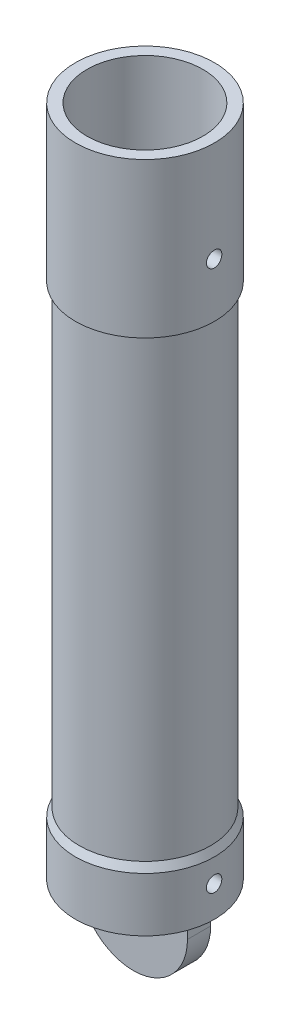
ISO-10303-21;
HEADER;
FILE_DESCRIPTION(('STEP AP214'),'2;1');
FILE_NAME('part.step','',(''),(''),'','','');
FILE_SCHEMA(('AUTOMOTIVE_DESIGN { 1 0 10303 214 1 1 1 1 }'));
ENDSEC;
DATA;
#1=APPLICATION_CONTEXT('core data for automotive mechanical design processes');
#2=APPLICATION_PROTOCOL_DEFINITION('international standard','automotive_design',2000,#1);
#3=PRODUCT_CONTEXT('',#1,'mechanical');
#4=PRODUCT('Part','Part','',(#3));
#5=PRODUCT_RELATED_PRODUCT_CATEGORY('part','',(#4));
#6=PRODUCT_DEFINITION_FORMATION('','',#4);
#7=PRODUCT_DEFINITION_CONTEXT('part definition',#1,'design');
#8=PRODUCT_DEFINITION('design','',#6,#7);
#9=PRODUCT_DEFINITION_SHAPE('','',#8);
#10=(LENGTH_UNIT() NAMED_UNIT(*) SI_UNIT(.MILLI.,.METRE.));
#11=(NAMED_UNIT(*) PLANE_ANGLE_UNIT() SI_UNIT($,.RADIAN.));
#12=(NAMED_UNIT(*) SI_UNIT($,.STERADIAN.) SOLID_ANGLE_UNIT());
#13=UNCERTAINTY_MEASURE_WITH_UNIT(LENGTH_MEASURE(1.E-05),#10,'distance_accuracy_value','');
#14=(GEOMETRIC_REPRESENTATION_CONTEXT(3) GLOBAL_UNCERTAINTY_ASSIGNED_CONTEXT((#13)) GLOBAL_UNIT_ASSIGNED_CONTEXT((#10,
#11,#12)) REPRESENTATION_CONTEXT('',''));
#15=CARTESIAN_POINT('',(0.,0.,0.));
#16=DIRECTION('',(0.,0.,1.));
#17=DIRECTION('',(1.,0.,0.));
#18=AXIS2_PLACEMENT_3D('',#15,#16,#17);
#19=CARTESIAN_POINT('',(0.,87.,0.));
#20=DIRECTION('',(0.,1.,0.));
#21=DIRECTION('',(0.,0.,1.));
#22=AXIS2_PLACEMENT_3D('',#19,#20,#21);
#23=CYLINDRICAL_SURFACE('',#22,8.99999999999999);
#24=CARTESIAN_POINT('',(0.,6.99999999999999,0.));
#25=DIRECTION('',(0.,1.,0.));
#26=DIRECTION('',(0.,0.,1.));
#27=AXIS2_PLACEMENT_3D('',#24,#25,#26);
#28=CIRCLE('',#27,8.99999999999999);
#29=CARTESIAN_POINT('',(0.,6.99999999999999,8.99999999999999));
#30=VERTEX_POINT('',#29);
#31=EDGE_CURVE('E54',#30,#30,#28,.T.);
#32=ORIENTED_EDGE('',*,*,#31,.F.);
#33=EDGE_LOOP('',(#32));
#34=FACE_BOUND('',#33,.T.);
#35=CARTESIAN_POINT('',(0.,0.,0.));
#36=DIRECTION('',(0.,1.,0.));
#37=DIRECTION('',(0.,0.,1.));
#38=AXIS2_PLACEMENT_3D('',#35,#36,#37);
#39=CIRCLE('',#38,8.99999999999998);
#40=CARTESIAN_POINT('',(0.,0.,8.99999999999998));
#41=VERTEX_POINT('',#40);
#42=EDGE_CURVE('E11',#41,#41,#39,.T.);
#43=ORIENTED_EDGE('',*,*,#42,.T.);
#44=EDGE_LOOP('',(#43));
#45=FACE_BOUND('',#44,.T.);
#46=CARTESIAN_POINT('',(8.94427190999915,4.,0.999999999999991));
#47=CARTESIAN_POINT('',(8.94427263367564,4.0559841134771,0.999997592517866));
#48=CARTESIAN_POINT('',(8.94480320415308,4.1120043997645,0.995282822112467));
#49=CARTESIAN_POINT('',(8.94686765346893,4.22248934405692,0.976547278566342));
#50=CARTESIAN_POINT('',(8.94840261407587,4.27695225862483,0.962516471439655));
#51=CARTESIAN_POINT('',(8.95229988148852,4.38270661902511,0.925564609414928));
#52=CARTESIAN_POINT('',(8.95466166163705,4.43400005929836,0.90264921271523));
#53=CARTESIAN_POINT('',(8.95994581317674,4.53200251564655,0.84859006992609));
#54=CARTESIAN_POINT('',(8.96286807969104,4.57871238692008,0.817447862806936));
#55=CARTESIAN_POINT('',(8.9689585152234,4.66644024909067,0.747670331059766));
#56=CARTESIAN_POINT('',(8.97212761419109,4.70743491317915,0.709005756930013));
#57=CARTESIAN_POINT('',(8.97834623227898,4.7823675269533,0.625343781006231));
#58=CARTESIAN_POINT('',(8.98139574572674,4.8163051422211,0.580346079268701));
#59=CARTESIAN_POINT('',(8.98704094371251,4.87624237130181,0.485150487955424));
#60=CARTESIAN_POINT('',(8.98963542778045,4.9022211186168,0.434939383130966));
#61=CARTESIAN_POINT('',(8.99406807097665,4.94536961809943,0.33083373575899));
#62=CARTESIAN_POINT('',(8.99590625254781,4.96253963166566,0.276939302567778));
#63=CARTESIAN_POINT('',(8.99861263899253,4.98751424661088,0.16723400431094));
#64=CARTESIAN_POINT('',(8.99948483524638,4.99535739589416,0.111432014779645));
#65=CARTESIAN_POINT('',(9.00017457787682,5.00157499865148,-0.000702562392763186));
#66=CARTESIAN_POINT('',(8.9999921575105,4.99994975070937,-0.0570351332461794));
#67=CARTESIAN_POINT('',(8.99859647140739,4.98730781760897,-0.168369872939793));
#68=CARTESIAN_POINT('',(8.99738775579825,4.97633258532411,-0.223376813736908));
#69=CARTESIAN_POINT('',(8.99408046986786,4.94536690073653,-0.33076313724934));
#70=CARTESIAN_POINT('',(8.99198188570147,4.92537630816683,-0.38314247906863));
#71=CARTESIAN_POINT('',(8.98712289889433,4.87690248439166,-0.483916439759069));
#72=CARTESIAN_POINT('',(8.98436108245631,4.84840107884412,-0.532302245558599));
#73=CARTESIAN_POINT('',(8.9784851551257,4.78372788465659,-0.623619484715406));
#74=CARTESIAN_POINT('',(8.97537103146679,4.74755581801872,-0.666550720299529));
#75=CARTESIAN_POINT('',(8.96911970576882,4.66833535845642,-0.745983267326595));
#76=CARTESIAN_POINT('',(8.96598246993294,4.625250876728,-0.782448593166379));
#77=CARTESIAN_POINT('',(8.96005521211825,4.53355323765733,-0.847635154523864));
#78=CARTESIAN_POINT('',(8.95726519085753,4.48494006888121,-0.876356374025599));
#79=CARTESIAN_POINT('',(8.95234814495896,4.38353551326513,-0.925240185526878));
#80=CARTESIAN_POINT('',(8.95022131384814,4.33074291244021,-0.945400279904722));
#81=CARTESIAN_POINT('',(8.94687537727144,4.22249299212105,-0.976559666068446));
#82=CARTESIAN_POINT('',(8.94565623749051,4.16703577344642,-0.98755930416501));
#83=CARTESIAN_POINT('',(8.9442698173594,4.05534755348248,-1.00003867967785));
#84=CARTESIAN_POINT('',(8.9440969608419,3.99912225770337,-1.00156888541939));
#85=CARTESIAN_POINT('',(8.9448079519288,3.88721608648433,-0.995198759551084));
#86=CARTESIAN_POINT('',(8.94569178183337,3.83153520194108,-0.987298585903113));
#87=CARTESIAN_POINT('',(8.94841148256714,3.72244725733017,-0.962334295937802));
#88=CARTESIAN_POINT('',(8.95024484892915,3.66903461366211,-0.945294282379431));
#89=CARTESIAN_POINT('',(8.95465502047817,3.56582531440804,-0.902558706994963));
#90=CARTESIAN_POINT('',(8.95723184653214,3.51602876036521,-0.876862902220315));
#91=CARTESIAN_POINT('',(8.96285203814232,3.42123585340321,-0.817419705165285));
#92=CARTESIAN_POINT('',(8.96589731402505,3.37626049653097,-0.783639014378045));
#93=CARTESIAN_POINT('',(8.97210513969874,3.29260013138305,-0.709032406964774));
#94=CARTESIAN_POINT('',(8.97526769307831,3.25391531578897,-0.668206274613186));
#95=CARTESIAN_POINT('',(8.98137069627023,3.18375875733989,-0.580448104861658));
#96=CARTESIAN_POINT('',(8.98431008980797,3.15232003836093,-0.533489583366008));
#97=CARTESIAN_POINT('',(8.98962004039812,3.0977758715866,-0.4349295798185));
#98=CARTESIAN_POINT('',(8.99199060680961,3.07467028668082,-0.383328174176462));
#99=CARTESIAN_POINT('',(8.99589107248184,3.03750363555143,-0.277060132472978));
#100=CARTESIAN_POINT('',(8.9974227910967,3.02342298399711,-0.222400415783423));
#101=CARTESIAN_POINT('',(8.99948048346295,3.00464205926624,-0.111474600378969));
#102=CARTESIAN_POINT('',(9.00000649258982,2.99994145614946,-0.0552085582366774));
#103=CARTESIAN_POINT('',(8.99999341978675,3.0000593318663,0.0570091672484356));
#104=CARTESIAN_POINT('',(8.99946005766743,3.00482669078709,0.112960911922288));
#105=CARTESIAN_POINT('',(8.99739948433674,3.02363751839051,0.223263158463222));
#106=CARTESIAN_POINT('',(8.99587227289396,3.03768098923301,0.277613659957462));
#107=CARTESIAN_POINT('',(8.99199497720235,3.07463042201869,0.383167538307865));
#108=CARTESIAN_POINT('',(8.98964506961353,3.09753448141185,0.434371588038429));
#109=CARTESIAN_POINT('',(8.98438359909208,3.15154959198276,0.532216958324803));
#110=CARTESIAN_POINT('',(8.98147203523691,3.18266065664069,0.578858271386052));
#111=CARTESIAN_POINT('',(8.97539414841482,3.25239744820852,0.666515949250362));
#112=CARTESIAN_POINT('',(8.97222658393825,3.29106126569852,0.707501925820602));
#113=CARTESIAN_POINT('',(8.96600400083303,3.3747286645393,0.782425417953726));
#114=CARTESIAN_POINT('',(8.96294900923111,3.41973375596681,0.816361249856326));
#115=CARTESIAN_POINT('',(8.95728742883614,3.51496158983686,0.876307066925751));
#116=CARTESIAN_POINT('',(8.95468224997416,3.56519997432892,0.902292320826923));
#117=CARTESIAN_POINT('',(8.95023190563829,3.66932571842171,0.945422239485245));
#118=CARTESIAN_POINT('',(8.94838589612408,3.72320894763475,0.962576727612482));
#119=CARTESIAN_POINT('',(8.9461212655064,3.81448893747225,0.9833512157742));
#120=CARTESIAN_POINT('',(8.9454311087166,3.85130518115984,0.989585793834217));
#121=CARTESIAN_POINT('',(8.94450619111617,3.92540893153466,0.997910976611049));
#122=CARTESIAN_POINT('',(8.94427142779606,3.96269643562383,1.00000160416337));
#123=CARTESIAN_POINT('',(8.94427190999915,4.,0.999999999999991));
#124=B_SPLINE_CURVE_WITH_KNOTS('',3,(#46,#47,#48,#49,#50,#51,#52,#53,#54,#55,#56,#57,#58,#59,
#60,#61,#62,#63,#64,#65,#66,#67,#68,#69,#70,#71,#72,#73,#74,#75,#76,#77,#78,#79,#80,#81,#82,#83,
#84,#85,#86,#87,#88,#89,#90,#91,#92,#93,#94,#95,#96,#97,#98,#99,#100,#101,#102,#103,#104,#105,
#106,#107,#108,#109,#110,#111,#112,#113,#114,#115,#116,#117,#118,#119,#120,#121,#122,#123),
.UNSPECIFIED.,.T.,.F.,(4,2,2,2,2,2,2,2,2,2,2,2,2,2,2,2,2,2,2,2,2,2,2,2,2,2,2,2,2,2,2,2,2,2,2,2,
2,2,4),(0.,0.167816094312486,0.335813231467328,0.503703554025014,0.671562491943662,
0.840087659677712,1.00862081162626,1.17759211396053,1.34655840179297,1.51482389806978,
1.68308408815944,1.85060216087683,2.01812284004196,2.18600383962577,2.35389092454426,
2.52268489532751,2.69147921519915,2.8603227453326,3.02915989205335,3.19709642315278,
3.36503014130095,3.53252316164429,3.70002088353095,3.86822070886243,4.03642568524668,
4.20538272665268,4.37433698797281,4.54292334295312,4.71150376785724,4.8791764590021,
5.0468491891884,5.21448593656706,5.38212295929421,5.55062832814459,5.71917389198524,
5.88823852910646,6.05711468959689,6.16893521484786,6.28075512390304),.UNSPECIFIED.);
#125=CARTESIAN_POINT('',(8.94427190999915,4.,0.999999999999991));
#126=VERTEX_POINT('',#125);
#127=EDGE_CURVE('E181',#126,#126,#124,.T.);
#128=ORIENTED_EDGE('',*,*,#127,.T.);
#129=EDGE_LOOP('',(#128));
#130=FACE_BOUND('',#129,.T.);
#131=ADVANCED_FACE('F39',(#34,#45,#130),#23,.T.);
#132=CARTESIAN_POINT('',(0.,87.,0.));
#133=DIRECTION('',(0.,1.,0.));
#134=DIRECTION('',(0.,0.,1.));
#135=AXIS2_PLACEMENT_3D('',#132,#133,#134);
#136=CYLINDRICAL_SURFACE('',#135,9.);
#137=CARTESIAN_POINT('',(0.,87.,0.));
#138=DIRECTION('',(0.,1.,0.));
#139=DIRECTION('',(0.,0.,1.));
#140=AXIS2_PLACEMENT_3D('',#137,#138,#139);
#141=CIRCLE('',#140,9.);
#142=CARTESIAN_POINT('',(0.,87.,9.));
#143=VERTEX_POINT('',#142);
#144=EDGE_CURVE('E156',#143,#143,#141,.T.);
#145=ORIENTED_EDGE('',*,*,#144,.F.);
#146=EDGE_LOOP('',(#145));
#147=FACE_BOUND('',#146,.T.);
#148=CARTESIAN_POINT('',(0.,67.,0.));
#149=DIRECTION('',(0.,1.,0.));
#150=DIRECTION('',(0.,0.,1.));
#151=AXIS2_PLACEMENT_3D('',#148,#149,#150);
#152=CIRCLE('',#151,9.);
#153=CARTESIAN_POINT('',(0.,67.,9.));
#154=VERTEX_POINT('',#153);
#155=EDGE_CURVE('E160',#154,#154,#152,.T.);
#156=ORIENTED_EDGE('',*,*,#155,.T.);
#157=EDGE_LOOP('',(#156));
#158=FACE_BOUND('',#157,.T.);
#159=CARTESIAN_POINT('',(8.94427190999916,74.,1.));
#160=CARTESIAN_POINT('',(8.94427263367565,74.0559841134771,0.999997592517876));
#161=CARTESIAN_POINT('',(8.94480320415309,74.1120043997645,0.995282822112477));
#162=CARTESIAN_POINT('',(8.94686765346894,74.2224893440569,0.976547278566351));
#163=CARTESIAN_POINT('',(8.94840261407588,74.2769522586248,0.962516471439663));
#164=CARTESIAN_POINT('',(8.95229988148853,74.3827066190251,0.925564609414937));
#165=CARTESIAN_POINT('',(8.95466166163706,74.4340000592984,0.902649212715241));
#166=CARTESIAN_POINT('',(8.95994581317675,74.5320025156466,0.8485900699261));
#167=CARTESIAN_POINT('',(8.96286807969105,74.5787123869201,0.81744786280694));
#168=CARTESIAN_POINT('',(8.96895851522341,74.6664402490907,0.747670331059766));
#169=CARTESIAN_POINT('',(8.9721276141911,74.7074349131792,0.709005756930015));
#170=CARTESIAN_POINT('',(8.97834623227899,74.7823675269533,0.625343781006238));
#171=CARTESIAN_POINT('',(8.98139574572675,74.8163051422211,0.58034607926871));
#172=CARTESIAN_POINT('',(8.98704094371252,74.8762423713018,0.485150487955433));
#173=CARTESIAN_POINT('',(8.98963542778046,74.9022211186168,0.434939383130973));
#174=CARTESIAN_POINT('',(8.99406807097666,74.9453696180994,0.330833735758996));
#175=CARTESIAN_POINT('',(8.99590625254782,74.9625396316657,0.276939302567785));
#176=CARTESIAN_POINT('',(8.99861263899254,74.9875142466109,0.167234004310947));
#177=CARTESIAN_POINT('',(8.99948483524639,74.9953573958942,0.111432014779651));
#178=CARTESIAN_POINT('',(9.00017457787683,75.0015749986515,-0.0007025623927587));
#179=CARTESIAN_POINT('',(8.99999215751051,74.9999497507094,-0.0570351332461753));
#180=CARTESIAN_POINT('',(8.9985964714074,74.987307817609,-0.16836987293979));
#181=CARTESIAN_POINT('',(8.99738775579826,74.9763325853241,-0.223376813736905));
#182=CARTESIAN_POINT('',(8.99408046986786,74.9453669007365,-0.330763137249337));
#183=CARTESIAN_POINT('',(8.99198188570148,74.9253763081668,-0.383142479068627));
#184=CARTESIAN_POINT('',(8.98712289889434,74.8769024843917,-0.483916439759064));
#185=CARTESIAN_POINT('',(8.98436108245632,74.8484010788441,-0.532302245558592));
#186=CARTESIAN_POINT('',(8.97848515512571,74.7837278846566,-0.623619484715399));
#187=CARTESIAN_POINT('',(8.9753710314668,74.7475558180187,-0.666550720299525));
#188=CARTESIAN_POINT('',(8.96911970576883,74.6683353584564,-0.745983267326595));
#189=CARTESIAN_POINT('',(8.96598246993295,74.625250876728,-0.782448593166381));
#190=CARTESIAN_POINT('',(8.96005521211826,74.5335532376573,-0.847635154523864));
#191=CARTESIAN_POINT('',(8.95726519085754,74.4849400688812,-0.876356374025597));
#192=CARTESIAN_POINT('',(8.95234814495897,74.3835355132651,-0.925240185526874));
#193=CARTESIAN_POINT('',(8.95022131384815,74.3307429124402,-0.945400279904718));
#194=CARTESIAN_POINT('',(8.94687537727145,74.222492992121,-0.976559666068442));
#195=CARTESIAN_POINT('',(8.94565623749051,74.1670357734464,-0.987559304165004));
#196=CARTESIAN_POINT('',(8.94426981735941,74.0553475534825,-1.00003867967784));
#197=CARTESIAN_POINT('',(8.94409696084191,73.9991222577034,-1.00156888541938));
#198=CARTESIAN_POINT('',(8.94480795192882,73.8872160864843,-0.995198759551076));
#199=CARTESIAN_POINT('',(8.94569178183338,73.8315352019411,-0.987298585903106));
#200=CARTESIAN_POINT('',(8.94841148256715,73.7224472573302,-0.962334295937791));
#201=CARTESIAN_POINT('',(8.95024484892916,73.6690346136621,-0.945294282379418));
#202=CARTESIAN_POINT('',(8.95465502047819,73.565825314408,-0.902558706994948));
#203=CARTESIAN_POINT('',(8.95723184653215,73.5160287603652,-0.876862902220301));
#204=CARTESIAN_POINT('',(8.96285203814234,73.4212358534032,-0.817419705165268));
#205=CARTESIAN_POINT('',(8.96589731402506,73.376260496531,-0.783639014378022));
#206=CARTESIAN_POINT('',(8.97210513969875,73.292600131383,-0.709032406964749));
#207=CARTESIAN_POINT('',(8.97526769307832,73.253915315789,-0.668206274613162));
#208=CARTESIAN_POINT('',(8.98137069627024,73.1837587573399,-0.58044810486164));
#209=CARTESIAN_POINT('',(8.98431008980798,73.1523200383609,-0.533489583365995));
#210=CARTESIAN_POINT('',(8.98962004039814,73.0977758715866,-0.43492957981849));
#211=CARTESIAN_POINT('',(8.99199060680962,73.0746702866808,-0.383328174176451));
#212=CARTESIAN_POINT('',(8.99589107248185,73.0375036355514,-0.277060132472965));
#213=CARTESIAN_POINT('',(8.99742279109672,73.0234229839971,-0.222400415783409));
#214=CARTESIAN_POINT('',(8.99948048346296,73.0046420592662,-0.111474600378956));
#215=CARTESIAN_POINT('',(9.00000649258983,72.9999414561495,-0.0552085582366637));
#216=CARTESIAN_POINT('',(8.99999341978676,73.0000593318663,0.0570091672484495));
#217=CARTESIAN_POINT('',(8.99946005766744,73.0048266907871,0.112960911922302));
#218=CARTESIAN_POINT('',(8.99739948433675,73.0236375183905,0.223263158463236));
#219=CARTESIAN_POINT('',(8.99587227289397,73.037680989233,0.277613659957476));
#220=CARTESIAN_POINT('',(8.99199497720236,73.0746304220187,0.383167538307879));
#221=CARTESIAN_POINT('',(8.98964506961354,73.0975344814119,0.434371588038443));
#222=CARTESIAN_POINT('',(8.98438359909209,73.1515495919828,0.532216958324815));
#223=CARTESIAN_POINT('',(8.98147203523692,73.1826606566407,0.578858271386064));
#224=CARTESIAN_POINT('',(8.97539414841483,73.2523974482085,0.666515949250374));
#225=CARTESIAN_POINT('',(8.97222658393826,73.2910612656985,0.707501925820614));
#226=CARTESIAN_POINT('',(8.96600400083303,73.3747286645393,0.782425417953737));
#227=CARTESIAN_POINT('',(8.96294900923112,73.4197337559668,0.816361249856338));
#228=CARTESIAN_POINT('',(8.95728742883615,73.5149615898369,0.876307066925761));
#229=CARTESIAN_POINT('',(8.95468224997417,73.5651999743289,0.902292320826932));
#230=CARTESIAN_POINT('',(8.9502319056383,73.6693257184217,0.945422239485254));
#231=CARTESIAN_POINT('',(8.94838589612409,73.7232089476347,0.962576727612491));
#232=CARTESIAN_POINT('',(8.94612126550641,73.8144889374722,0.983351215774209));
#233=CARTESIAN_POINT('',(8.94543110871662,73.8513051811598,0.989585793834225));
#234=CARTESIAN_POINT('',(8.94450619111618,73.9254089315347,0.997910976611058));
#235=CARTESIAN_POINT('',(8.94427142779607,73.9626964356238,1.00000160416337));
#236=CARTESIAN_POINT('',(8.94427190999916,74.,1.));
#237=B_SPLINE_CURVE_WITH_KNOTS('',3,(#159,#160,#161,#162,#163,#164,#165,#166,#167,#168,#169,
#170,#171,#172,#173,#174,#175,#176,#177,#178,#179,#180,#181,#182,#183,#184,#185,#186,#187,#188,
#189,#190,#191,#192,#193,#194,#195,#196,#197,#198,#199,#200,#201,#202,#203,#204,#205,#206,#207,
#208,#209,#210,#211,#212,#213,#214,#215,#216,#217,#218,#219,#220,#221,#222,#223,#224,#225,#226,
#227,#228,#229,#230,#231,#232,#233,#234,#235,#236),.UNSPECIFIED.,.T.,.F.,(4,2,2,2,2,2,2,2,2,2,2,
2,2,2,2,2,2,2,2,2,2,2,2,2,2,2,2,2,2,2,2,2,2,2,2,2,2,2,4),(0.,0.167816094312494,
0.335813231467332,0.503703554025,0.671562491943676,0.840087659677715,1.00862081162626,
1.17759211396053,1.34655840179297,1.51482389806979,1.68308408815945,1.85060216087684,
2.01812284004197,2.18600383962578,2.35389092454426,2.52268489532752,2.69147921519917,
2.86032274533261,3.02915989205336,3.19709642315279,3.36503014130096,3.5325231616443,
3.70002088353097,3.86822070886246,4.0364256852467,4.20538272665269,4.37433698797282,
4.54292334295313,4.71150376785725,4.87917645900211,5.04684918918841,5.21448593656708,
5.38212295929422,5.5506283281446,5.71917389198526,5.88823852910646,6.0571146895969,
6.16893521484787,6.28075512390305),.UNSPECIFIED.);
#238=CARTESIAN_POINT('',(8.94427190999916,74.,1.));
#239=VERTEX_POINT('',#238);
#240=EDGE_CURVE('E118',#239,#239,#237,.T.);
#241=ORIENTED_EDGE('',*,*,#240,.T.);
#242=EDGE_LOOP('',(#241));
#243=FACE_BOUND('',#242,.T.);
#244=ADVANCED_FACE('F208',(#147,#158,#243),#136,.T.);
#245=CARTESIAN_POINT('',(0.,87.,0.));
#246=DIRECTION('',(0.,1.,0.));
#247=DIRECTION('',(0.,0.,1.));
#248=AXIS2_PLACEMENT_3D('',#245,#246,#247);
#249=CYLINDRICAL_SURFACE('',#248,7.49999999999999);
#250=CARTESIAN_POINT('',(7.43303437365924,4.,0.999999999999991));
#251=CARTESIAN_POINT('',(7.43303522266629,3.94409807226988,0.999997642974202));
#252=CARTESIAN_POINT('',(7.43367182371828,3.88816198345359,0.995296633522838));
#253=CARTESIAN_POINT('',(7.43614824351762,3.77784876884304,0.976618981332764));
#254=CARTESIAN_POINT('',(7.43798929330703,3.72347329754359,0.962632848245777));
#255=CARTESIAN_POINT('',(7.44266246058433,3.61789431588298,0.925806555700504));
#256=CARTESIAN_POINT('',(7.44549387777219,3.56668859419012,0.902972651374997));
#257=CARTESIAN_POINT('',(7.4518279112973,3.46884446214626,0.849112824403639));
#258=CARTESIAN_POINT('',(7.45533041990362,3.42220532053127,0.818088216317394));
#259=CARTESIAN_POINT('',(7.46263688659336,3.33451327266549,0.748516852447521));
#260=CARTESIAN_POINT('',(7.46644244246589,3.29349356716024,0.709928411374272));
#261=CARTESIAN_POINT('',(7.47391188129392,3.21849187727189,0.626414614363058));
#262=CARTESIAN_POINT('',(7.47757575696695,3.18451025426193,0.581488933235986));
#263=CARTESIAN_POINT('',(7.48436549880107,3.12442907914178,0.486365862463793));
#264=CARTESIAN_POINT('',(7.48748928251117,3.09835975535487,0.436149218855601));
#265=CARTESIAN_POINT('',(7.49282926707923,3.05503691790961,0.332001908018675));
#266=CARTESIAN_POINT('',(7.49504550607302,3.03778303381116,0.278071396961191));
#267=CARTESIAN_POINT('',(7.49830943097797,3.01268054520987,0.168367687507035));
#268=CARTESIAN_POINT('',(7.49936399102535,3.00477659249402,0.11260736173494));
#269=CARTESIAN_POINT('',(7.50020923985758,2.99842669563159,0.000542501151819366));
#270=CARTESIAN_POINT('',(7.49999998481414,2.99998033113174,-0.0557620093612419));
#271=CARTESIAN_POINT('',(7.49834672058452,3.01245736527048,-0.166940062232893));
#272=CARTESIAN_POINT('',(7.49691055668902,3.02332123237283,-0.221820418680901));
#273=CARTESIAN_POINT('',(7.49297362046143,3.05401716351076,-0.328972061356286));
#274=CARTESIAN_POINT('',(7.49047282557015,3.07384941758406,-0.381243292270928));
#275=CARTESIAN_POINT('',(7.48467409502081,3.12198172056091,-0.481875904212073));
#276=CARTESIAN_POINT('',(7.48137376072938,3.15030731159154,-0.530224924676639));
#277=CARTESIAN_POINT('',(7.47434475209519,3.21460362864143,-0.621505845367402));
#278=CARTESIAN_POINT('',(7.47061605542143,3.2505747533139,-0.664437462933417));
#279=CARTESIAN_POINT('',(7.46311294047829,3.32947392417947,-0.744015030772702));
#280=CARTESIAN_POINT('',(7.45933839212198,3.37245388409682,-0.780609516765114));
#281=CARTESIAN_POINT('',(7.45219749384617,3.46397296568629,-0.846073465285964));
#282=CARTESIAN_POINT('',(7.44883114554536,3.51251210940149,-0.874942897181775));
#283=CARTESIAN_POINT('',(7.44288788167169,3.61382000017335,-0.92414143043251));
#284=CARTESIAN_POINT('',(7.44031138107391,3.66659095225925,-0.944466044533542));
#285=CARTESIAN_POINT('',(7.43624737732858,3.77483901031919,-0.975950450224629));
#286=CARTESIAN_POINT('',(7.4347598141808,3.83031596701329,-0.987110746770726));
#287=CARTESIAN_POINT('',(7.43305322505172,3.94194566750248,-0.999880803843644));
#288=CARTESIAN_POINT('',(7.43282455755813,3.99808996516627,-1.00156315549407));
#289=CARTESIAN_POINT('',(7.43363612148347,4.10985962805237,-0.995521440943988));
#290=CARTESIAN_POINT('',(7.43467632202373,4.16548500586973,-0.987797603648891));
#291=CARTESIAN_POINT('',(7.43789960218383,4.27441799320281,-0.963224025185108));
#292=CARTESIAN_POINT('',(7.44007823893824,4.32773374650905,-0.946409751616809));
#293=CARTESIAN_POINT('',(7.44532929507202,4.43078945672622,-0.904169225400636));
#294=CARTESIAN_POINT('',(7.4484017499142,4.48052927166186,-0.878742631046925));
#295=CARTESIAN_POINT('',(7.45511723309758,4.57534865522041,-0.819822032086064));
#296=CARTESIAN_POINT('',(7.45876356894566,4.62039852418412,-0.786280615831512));
#297=CARTESIAN_POINT('',(7.46620571758254,4.70425546921855,-0.712149161564004));
#298=CARTESIAN_POINT('',(7.47000153699965,4.74306226807401,-0.67155881071878));
#299=CARTESIAN_POINT('',(7.47734474327665,4.81358827696056,-0.584163774179128));
#300=CARTESIAN_POINT('',(7.48089035024857,4.84525965818581,-0.537320320466271));
#301=CARTESIAN_POINT('',(7.4873067073915,4.90028414108767,-0.438936226158819));
#302=CARTESIAN_POINT('',(7.49017747274244,4.92363742987806,-0.387395691256859));
#303=CARTESIAN_POINT('',(7.49491282345576,4.96128463079407,-0.281236386261726));
#304=CARTESIAN_POINT('',(7.4967804241039,4.97560571454178,-0.226627392123691));
#305=CARTESIAN_POINT('',(7.49931158343307,4.99487024273049,-0.115753246711609));
#306=CARTESIAN_POINT('',(7.49997520428061,4.99981417135386,-0.0594881810999214));
#307=CARTESIAN_POINT('',(7.50002323624208,5.00017413362016,0.0526349368557848));
#308=CARTESIAN_POINT('',(7.49941752456712,4.9956637352972,0.108492762960931));
#309=CARTESIAN_POINT('',(7.49701466609929,4.97739947938401,0.218648721526167));
#310=CARTESIAN_POINT('',(7.49521752097503,4.96364563473935,0.272946856170514));
#311=CARTESIAN_POINT('',(7.49063278321233,4.92730897646167,0.37842911729442));
#312=CARTESIAN_POINT('',(7.48784564204156,4.90473018679597,0.429614650771946));
#313=CARTESIAN_POINT('',(7.4815887469799,4.85139222517713,0.527482039315428));
#314=CARTESIAN_POINT('',(7.47811898048493,4.82063290217378,0.574163811199573));
#315=CARTESIAN_POINT('',(7.47085145604925,4.75153665899818,0.662073643033359));
#316=CARTESIAN_POINT('',(7.46705145149954,4.71314510493041,0.70325857858199));
#317=CARTESIAN_POINT('',(7.45956932448382,4.62998846547632,0.778629477936071));
#318=CARTESIAN_POINT('',(7.45588723005031,4.58522187803936,0.812813787651147));
#319=CARTESIAN_POINT('',(7.44904054942528,4.49035802921457,0.873343954892469));
#320=CARTESIAN_POINT('',(7.44587830880395,4.44023820424499,0.899654702145631));
#321=CARTESIAN_POINT('',(7.44045683291869,4.33627576624144,0.943447591407433));
#322=CARTESIAN_POINT('',(7.43819663011142,4.28243721512017,0.960939198331785));
#323=CARTESIAN_POINT('',(7.4353756691247,4.19027586063734,0.98247740189293));
#324=CARTESIAN_POINT('',(7.43450214311109,4.15253086351626,0.989038740679081));
#325=CARTESIAN_POINT('',(7.4333312073723,4.07652924526443,0.99780082671582));
#326=CARTESIAN_POINT('',(7.43303379239607,4.0382726288001,1.0000016137113));
#327=CARTESIAN_POINT('',(7.43303437365924,4.,0.999999999999991));
#328=B_SPLINE_CURVE_WITH_KNOTS('',3,(#250,#251,#252,#253,#254,#255,#256,#257,#258,#259,#260,
#261,#262,#263,#264,#265,#266,#267,#268,#269,#270,#271,#272,#273,#274,#275,#276,#277,#278,#279,
#280,#281,#282,#283,#284,#285,#286,#287,#288,#289,#290,#291,#292,#293,#294,#295,#296,#297,#298,
#299,#300,#301,#302,#303,#304,#305,#306,#307,#308,#309,#310,#311,#312,#313,#314,#315,#316,#317,
#318,#319,#320,#321,#322,#323,#324,#325,#326,#327),.UNSPECIFIED.,.T.,.F.,(4,2,2,2,2,2,2,2,2,2,2,
2,2,2,2,2,2,2,2,2,2,2,2,2,2,2,2,2,2,2,2,2,2,2,2,2,2,2,4),(0.,0.16756594461955,0.335303423041821,
0.502922531373103,0.670514754163761,0.839057975594806,1.00760984880017,1.17679778261471,
1.34597860627362,1.51415284761382,1.68231961431326,1.84941904333874,2.01652201332237,
2.18413264227024,2.35175201291212,2.52067457533377,2.68959780758443,2.85860963826768,
3.02761215573449,3.19531851289863,3.36302078890669,3.53007342408195,3.69713268808003,
3.86519264070064,4.03326005374208,4.2024225588115,4.37158125836474,4.54022861884065,
4.70886727109971,4.87619854927048,5.04352959309218,5.21078442673995,5.37804234889437,
5.54654371183369,5.71508484203598,5.88436670989948,6.05346651155517,6.16818970471025,
6.28291185219902),.UNSPECIFIED.);
#329=CARTESIAN_POINT('',(7.43303437365924,4.,0.999999999999991));
#330=VERTEX_POINT('',#329);
#331=EDGE_CURVE('E174',#330,#330,#328,.T.);
#332=ORIENTED_EDGE('',*,*,#331,.T.);
#333=EDGE_LOOP('',(#332));
#334=FACE_BOUND('',#333,.T.);
#335=CARTESIAN_POINT('',(0.,87.,0.));
#336=DIRECTION('',(0.,1.,0.));
#337=DIRECTION('',(0.,0.,1.));
#338=AXIS2_PLACEMENT_3D('',#335,#336,#337);
#339=CIRCLE('',#338,7.49999999999999);
#340=CARTESIAN_POINT('',(0.,87.,7.49999999999999));
#341=VERTEX_POINT('',#340);
#342=EDGE_CURVE('E152',#341,#341,#339,.T.);
#343=ORIENTED_EDGE('',*,*,#342,.T.);
#344=EDGE_LOOP('',(#343));
#345=FACE_BOUND('',#344,.T.);
#346=CARTESIAN_POINT('',(0.,2.,0.));
#347=DIRECTION('',(0.,1.,0.));
#348=DIRECTION('',(0.,0.,1.));
#349=AXIS2_PLACEMENT_3D('',#346,#347,#348);
#350=CIRCLE('',#349,7.49999999999998);
#351=CARTESIAN_POINT('',(0.,2.,7.49999999999998));
#352=VERTEX_POINT('',#351);
#353=EDGE_CURVE('E143',#352,#352,#350,.T.);
#354=ORIENTED_EDGE('',*,*,#353,.F.);
#355=EDGE_LOOP('',(#354));
#356=FACE_BOUND('',#355,.T.);
#357=CARTESIAN_POINT('',(7.43303437365924,74.,1.));
#358=CARTESIAN_POINT('',(7.43303522266629,73.9440980722699,0.999997642974211));
#359=CARTESIAN_POINT('',(7.43367182371827,73.8881619834536,0.995296633522848));
#360=CARTESIAN_POINT('',(7.43614824351762,73.777848768843,0.976618981332774));
#361=CARTESIAN_POINT('',(7.43798929330703,73.7234732975436,0.962632848245786));
#362=CARTESIAN_POINT('',(7.44266246058433,73.617894315883,0.925806555700512));
#363=CARTESIAN_POINT('',(7.44549387777219,73.5666885941901,0.902972651375005));
#364=CARTESIAN_POINT('',(7.4518279112973,73.4688444621463,0.849112824403647));
#365=CARTESIAN_POINT('',(7.45533041990362,73.4222053205313,0.818088216317403));
#366=CARTESIAN_POINT('',(7.46263688659336,73.3345132726655,0.748516852447532));
#367=CARTESIAN_POINT('',(7.46644244246589,73.2934935671603,0.709928411374284));
#368=CARTESIAN_POINT('',(7.47391188129392,73.2184918772719,0.626414614363071));
#369=CARTESIAN_POINT('',(7.47757575696695,73.1845102542619,0.581488933235999));
#370=CARTESIAN_POINT('',(7.48436549880107,73.1244290791418,0.486365862463805));
#371=CARTESIAN_POINT('',(7.48748928251117,73.0983597553549,0.436149218855612));
#372=CARTESIAN_POINT('',(7.49282926707923,73.0550369179096,0.332001908018686));
#373=CARTESIAN_POINT('',(7.49504550607302,73.0377830338112,0.278071396961202));
#374=CARTESIAN_POINT('',(7.49830943097797,73.0126805452099,0.168367687507045));
#375=CARTESIAN_POINT('',(7.49936399102535,73.004776592494,0.112607361734949));
#376=CARTESIAN_POINT('',(7.50020923985758,72.9984266956316,0.000542501151827457));
#377=CARTESIAN_POINT('',(7.49999998481414,72.9999803311317,-0.055762009361234));
#378=CARTESIAN_POINT('',(7.49834672058452,73.0124573652705,-0.166940062232887));
#379=CARTESIAN_POINT('',(7.49691055668902,73.0233212323728,-0.221820418680895));
#380=CARTESIAN_POINT('',(7.49297362046143,73.0540171635108,-0.32897206135628));
#381=CARTESIAN_POINT('',(7.49047282557015,73.0738494175841,-0.381243292270921));
#382=CARTESIAN_POINT('',(7.48467409502081,73.1219817205609,-0.481875904212065));
#383=CARTESIAN_POINT('',(7.48137376072938,73.1503073115916,-0.530224924676632));
#384=CARTESIAN_POINT('',(7.47434475209519,73.2146036286414,-0.621505845367397));
#385=CARTESIAN_POINT('',(7.47061605542143,73.2505747533139,-0.664437462933413));
#386=CARTESIAN_POINT('',(7.46311294047829,73.3294739241795,-0.744015030772698));
#387=CARTESIAN_POINT('',(7.45933839212198,73.3724538840968,-0.780609516765108));
#388=CARTESIAN_POINT('',(7.45219749384617,73.4639729656863,-0.846073465285955));
#389=CARTESIAN_POINT('',(7.44883114554536,73.5125121094015,-0.874942897181765));
#390=CARTESIAN_POINT('',(7.44288788167169,73.6138200001734,-0.9241414304325));
#391=CARTESIAN_POINT('',(7.44031138107392,73.6665909522592,-0.944466044533533));
#392=CARTESIAN_POINT('',(7.43624737732858,73.7748390103192,-0.97595045022462));
#393=CARTESIAN_POINT('',(7.4347598141808,73.8303159670133,-0.987110746770718));
#394=CARTESIAN_POINT('',(7.43305322505172,73.9419456675025,-0.999880803843636));
#395=CARTESIAN_POINT('',(7.43282455755813,73.9980899651663,-1.00156315549406));
#396=CARTESIAN_POINT('',(7.43363612148348,74.1098596280524,-0.995521440943981));
#397=CARTESIAN_POINT('',(7.43467632202373,74.1654850058697,-0.987797603648884));
#398=CARTESIAN_POINT('',(7.43789960218384,74.2744179932028,-0.963224025185101));
#399=CARTESIAN_POINT('',(7.44007823893824,74.3277337465091,-0.946409751616803));
#400=CARTESIAN_POINT('',(7.44532929507202,74.4307894567262,-0.90416922540063));
#401=CARTESIAN_POINT('',(7.4484017499142,74.4805292716619,-0.878742631046917));
#402=CARTESIAN_POINT('',(7.45511723309758,74.5753486552204,-0.819822032086054));
#403=CARTESIAN_POINT('',(7.45876356894566,74.6203985241841,-0.786280615831502));
#404=CARTESIAN_POINT('',(7.46620571758254,74.7042554692186,-0.712149161563995));
#405=CARTESIAN_POINT('',(7.47000153699965,74.743062268074,-0.67155881071877));
#406=CARTESIAN_POINT('',(7.47734474327665,74.8135882769606,-0.58416377417912));
#407=CARTESIAN_POINT('',(7.48089035024857,74.8452596581858,-0.537320320466264));
#408=CARTESIAN_POINT('',(7.4873067073915,74.9002841410877,-0.438936226158812));
#409=CARTESIAN_POINT('',(7.49017747274245,74.9236374298781,-0.387395691256852));
#410=CARTESIAN_POINT('',(7.49491282345576,74.9612846307941,-0.281236386261718));
#411=CARTESIAN_POINT('',(7.4967804241039,74.9756057145418,-0.226627392123683));
#412=CARTESIAN_POINT('',(7.49931158343307,74.9948702427305,-0.1157532467116));
#413=CARTESIAN_POINT('',(7.49997520428061,74.9998141713539,-0.059488181099912));
#414=CARTESIAN_POINT('',(7.50002323624208,75.0001741336202,0.0526349368557938));
#415=CARTESIAN_POINT('',(7.49941752456712,74.9956637352972,0.108492762960939));
#416=CARTESIAN_POINT('',(7.49701466609929,74.977399479384,0.218648721526176));
#417=CARTESIAN_POINT('',(7.49521752097503,74.9636456347394,0.272946856170525));
#418=CARTESIAN_POINT('',(7.49063278321233,74.9273089764617,0.378429117294432));
#419=CARTESIAN_POINT('',(7.48784564204156,74.904730186796,0.429614650771956));
#420=CARTESIAN_POINT('',(7.4815887469799,74.8513922251772,0.527482039315437));
#421=CARTESIAN_POINT('',(7.47811898048493,74.8206329021738,0.574163811199583));
#422=CARTESIAN_POINT('',(7.47085145604925,74.7515366589982,0.662073643033372));
#423=CARTESIAN_POINT('',(7.46705145149954,74.7131451049304,0.703258578582004));
#424=CARTESIAN_POINT('',(7.45956932448382,74.6299884654763,0.778629477936085));
#425=CARTESIAN_POINT('',(7.45588723005031,74.5852218780394,0.812813787651159));
#426=CARTESIAN_POINT('',(7.44904054942528,74.4903580292146,0.87334395489248));
#427=CARTESIAN_POINT('',(7.44587830880395,74.440238204245,0.899654702145642));
#428=CARTESIAN_POINT('',(7.44045683291869,74.3362757662415,0.943447591407443));
#429=CARTESIAN_POINT('',(7.43819663011142,74.2824372151202,0.960939198331794));
#430=CARTESIAN_POINT('',(7.4353756691247,74.1902758606374,0.982477401892938));
#431=CARTESIAN_POINT('',(7.43450214311109,74.1525308635163,0.98903874067909));
#432=CARTESIAN_POINT('',(7.4333312073723,74.0765292452644,0.99780082671583));
#433=CARTESIAN_POINT('',(7.43303379239607,74.0382726288001,1.00000161371131));
#434=CARTESIAN_POINT('',(7.43303437365924,74.,1.));
#435=B_SPLINE_CURVE_WITH_KNOTS('',3,(#357,#358,#359,#360,#361,#362,#363,#364,#365,#366,#367,
#368,#369,#370,#371,#372,#373,#374,#375,#376,#377,#378,#379,#380,#381,#382,#383,#384,#385,#386,
#387,#388,#389,#390,#391,#392,#393,#394,#395,#396,#397,#398,#399,#400,#401,#402,#403,#404,#405,
#406,#407,#408,#409,#410,#411,#412,#413,#414,#415,#416,#417,#418,#419,#420,#421,#422,#423,#424,
#425,#426,#427,#428,#429,#430,#431,#432,#433,#434),.UNSPECIFIED.,.T.,.F.,(4,2,2,2,2,2,2,2,2,2,2,
2,2,2,2,2,2,2,2,2,2,2,2,2,2,2,2,2,2,2,2,2,2,2,2,2,2,2,4),(0.,0.167565944619552,
0.335303423041822,0.502922531373102,0.670514754163761,0.839057975594798,1.00760984880016,
1.17679778261471,1.34597860627362,1.51415284761383,1.68231961431326,1.84941904333875,
2.01652201332238,2.18413264227024,2.35175201291213,2.52067457533378,2.68959780758443,
2.85860963826769,3.0276121557345,3.19531851289863,3.36302078890669,3.53007342408195,
3.69713268808004,3.86519264070066,4.03326005374209,4.2024225588115,4.37158125836474,
4.54022861884066,4.70886727109972,4.87619854927049,5.04352959309219,5.21078442673996,
5.37804234889437,5.54654371183371,5.715084842036,5.88436670989948,6.05346651155518,
6.16818970471025,6.28291185219903),.UNSPECIFIED.);
#436=CARTESIAN_POINT('',(7.43303437365924,74.,1.));
#437=VERTEX_POINT('',#436);
#438=EDGE_CURVE('E43',#437,#437,#435,.T.);
#439=ORIENTED_EDGE('',*,*,#438,.T.);
#440=EDGE_LOOP('',(#439));
#441=FACE_BOUND('',#440,.T.);
#442=ADVANCED_FACE('F182',(#334,#345,#356,#441),#249,.F.);
#443=CARTESIAN_POINT('',(0.,0.,0.));
#444=DIRECTION('',(0.,-1.,0.));
#445=DIRECTION('',(0.,0.,-1.));
#446=AXIS2_PLACEMENT_3D('',#443,#444,#445);
#447=PLANE('',#446);
#448=ORIENTED_EDGE('',*,*,#42,.F.);
#449=EDGE_LOOP('',(#448));
#450=FACE_BOUND('',#449,.T.);
#451=DIRECTION('',(-1.,0.,0.));
#452=VECTOR('',#451,1.);
#453=CARTESIAN_POINT('',(-7.,0.,-1.5));
#454=LINE('',#453,#452);
#455=CARTESIAN_POINT('',(7.,0.,-1.5));
#456=VERTEX_POINT('',#455);
#457=CARTESIAN_POINT('',(-7.,0.,-1.5));
#458=VERTEX_POINT('',#457);
#459=EDGE_CURVE('E98',#456,#458,#454,.T.);
#460=ORIENTED_EDGE('',*,*,#459,.T.);
#461=DIRECTION('',(0.,0.,1.));
#462=VECTOR('',#461,1.);
#463=CARTESIAN_POINT('',(-7.,0.,-1.5));
#464=LINE('',#463,#462);
#465=CARTESIAN_POINT('',(-7.,0.,1.5));
#466=VERTEX_POINT('',#465);
#467=EDGE_CURVE('E140',#458,#466,#464,.T.);
#468=ORIENTED_EDGE('',*,*,#467,.T.);
#469=DIRECTION('',(-1.,0.,0.));
#470=VECTOR('',#469,1.);
#471=CARTESIAN_POINT('',(-7.,0.,1.5));
#472=LINE('',#471,#470);
#473=CARTESIAN_POINT('',(7.,0.,1.5));
#474=VERTEX_POINT('',#473);
#475=EDGE_CURVE('E112',#474,#466,#472,.T.);
#476=ORIENTED_EDGE('',*,*,#475,.F.);
#477=DIRECTION('',(0.,0.,1.));
#478=VECTOR('',#477,1.);
#479=CARTESIAN_POINT('',(7.,0.,-1.5));
#480=LINE('',#479,#478);
#481=EDGE_CURVE('E144',#456,#474,#480,.T.);
#482=ORIENTED_EDGE('',*,*,#481,.F.);
#483=EDGE_LOOP('',(#460,#468,#476,#482));
#484=FACE_BOUND('',#483,.T.);
#485=ADVANCED_FACE('F41',(#450,#484),#447,.T.);
#486=CARTESIAN_POINT('',(0.,7.99999999999999,0.));
#487=DIRECTION('',(0.,-1.,0.));
#488=DIRECTION('',(0.,0.,-1.));
#489=AXIS2_PLACEMENT_3D('',#486,#487,#488);
#490=CONICAL_SURFACE('',#489,8.49999999999999,0.463647609000806);
#491=ORIENTED_EDGE('',*,*,#31,.T.);
#492=EDGE_LOOP('',(#491));
#493=FACE_BOUND('',#492,.T.);
#494=CARTESIAN_POINT('',(0.,7.99999999999999,0.));
#495=DIRECTION('',(0.,1.,0.));
#496=DIRECTION('',(0.,0.,1.));
#497=AXIS2_PLACEMENT_3D('',#494,#495,#496);
#498=CIRCLE('',#497,8.49999999999999);
#499=CARTESIAN_POINT('',(0.,7.99999999999999,8.49999999999999));
#500=VERTEX_POINT('',#499);
#501=EDGE_CURVE('E168',#500,#500,#498,.T.);
#502=ORIENTED_EDGE('',*,*,#501,.F.);
#503=EDGE_LOOP('',(#502));
#504=FACE_BOUND('',#503,.T.);
#505=ADVANCED_FACE('F210',(#493,#504),#490,.T.);
#506=CARTESIAN_POINT('',(0.,87.,0.));
#507=DIRECTION('',(0.,1.,0.));
#508=DIRECTION('',(0.,0.,1.));
#509=AXIS2_PLACEMENT_3D('',#506,#507,#508);
#510=CYLINDRICAL_SURFACE('',#509,8.49999999999999);
#511=ORIENTED_EDGE('',*,*,#501,.T.);
#512=EDGE_LOOP('',(#511));
#513=FACE_BOUND('',#512,.T.);
#514=CARTESIAN_POINT('',(0.,67.,0.));
#515=DIRECTION('',(0.,1.,0.));
#516=DIRECTION('',(0.,0.,1.));
#517=AXIS2_PLACEMENT_3D('',#514,#515,#516);
#518=CIRCLE('',#517,8.49999999999999);
#519=CARTESIAN_POINT('',(0.,67.,8.49999999999999));
#520=VERTEX_POINT('',#519);
#521=EDGE_CURVE('E164',#520,#520,#518,.T.);
#522=ORIENTED_EDGE('',*,*,#521,.F.);
#523=EDGE_LOOP('',(#522));
#524=FACE_BOUND('',#523,.T.);
#525=ADVANCED_FACE('F213',(#513,#524),#510,.T.);
#526=CARTESIAN_POINT('',(-8.49999999999999,67.,0.));
#527=DIRECTION('',(0.,-1.,0.));
#528=DIRECTION('',(0.,0.,-1.));
#529=AXIS2_PLACEMENT_3D('',#526,#527,#528);
#530=PLANE('',#529);
#531=ORIENTED_EDGE('',*,*,#521,.T.);
#532=EDGE_LOOP('',(#531));
#533=FACE_BOUND('',#532,.T.);
#534=ORIENTED_EDGE('',*,*,#155,.F.);
#535=EDGE_LOOP('',(#534));
#536=FACE_BOUND('',#535,.T.);
#537=ADVANCED_FACE('F217',(#533,#536),#530,.T.);
#538=CARTESIAN_POINT('',(-9.,87.,0.));
#539=DIRECTION('',(0.,1.,0.));
#540=DIRECTION('',(0.,0.,1.));
#541=AXIS2_PLACEMENT_3D('',#538,#539,#540);
#542=PLANE('',#541);
#543=ORIENTED_EDGE('',*,*,#144,.T.);
#544=EDGE_LOOP('',(#543));
#545=FACE_BOUND('',#544,.T.);
#546=ORIENTED_EDGE('',*,*,#342,.F.);
#547=EDGE_LOOP('',(#546));
#548=FACE_BOUND('',#547,.T.);
#549=ADVANCED_FACE('F220',(#545,#548),#542,.T.);
#550=CARTESIAN_POINT('',(-7.49999999999998,2.,0.));
#551=DIRECTION('',(0.,1.,0.));
#552=DIRECTION('',(0.,0.,1.));
#553=AXIS2_PLACEMENT_3D('',#550,#551,#552);
#554=PLANE('',#553);
#555=ORIENTED_EDGE('',*,*,#353,.T.);
#556=EDGE_LOOP('',(#555));
#557=FACE_BOUND('',#556,.T.);
#558=ADVANCED_FACE('F226',(#557),#554,.T.);
#559=CARTESIAN_POINT('',(-7.,0.,-1.5));
#560=DIRECTION('',(-1.,0.,0.));
#561=DIRECTION('',(0.,-1.,0.));
#562=AXIS2_PLACEMENT_3D('',#559,#560,#561);
#563=PLANE('',#562);
#564=DIRECTION('',(0.,0.,1.));
#565=VECTOR('',#564,1.);
#566=CARTESIAN_POINT('',(-7.,-2.5,-1.5));
#567=LINE('',#566,#565);
#568=CARTESIAN_POINT('',(-7.,-2.5,-1.5));
#569=VERTEX_POINT('',#568);
#570=CARTESIAN_POINT('',(-7.,-2.5,1.5));
#571=VERTEX_POINT('',#570);
#572=EDGE_CURVE('E88',#569,#571,#567,.T.);
#573=ORIENTED_EDGE('',*,*,#572,.T.);
#574=DIRECTION('',(0.,-1.,0.));
#575=VECTOR('',#574,1.);
#576=CARTESIAN_POINT('',(-7.,0.,1.5));
#577=LINE('',#576,#575);
#578=EDGE_CURVE('E92',#466,#571,#577,.T.);
#579=ORIENTED_EDGE('',*,*,#578,.F.);
#580=ORIENTED_EDGE('',*,*,#467,.F.);
#581=DIRECTION('',(0.,-1.,0.));
#582=VECTOR('',#581,1.);
#583=CARTESIAN_POINT('',(-7.,0.,-1.5));
#584=LINE('',#583,#582);
#585=EDGE_CURVE('E62',#458,#569,#584,.T.);
#586=ORIENTED_EDGE('',*,*,#585,.T.);
#587=EDGE_LOOP('',(#573,#579,#580,#586));
#588=FACE_BOUND('',#587,.T.);
#589=ADVANCED_FACE('F90',(#588),#563,.T.);
#590=CARTESIAN_POINT('',(7.,0.,-1.5));
#591=DIRECTION('',(1.,0.,0.));
#592=DIRECTION('',(0.,0.,-1.));
#593=AXIS2_PLACEMENT_3D('',#590,#591,#592);
#594=PLANE('',#593);
#595=ORIENTED_EDGE('',*,*,#481,.T.);
#596=DIRECTION('',(0.,1.,0.));
#597=VECTOR('',#596,1.);
#598=CARTESIAN_POINT('',(7.,0.,1.5));
#599=LINE('',#598,#597);
#600=CARTESIAN_POINT('',(7.,-2.5,1.5));
#601=VERTEX_POINT('',#600);
#602=EDGE_CURVE('E107',#601,#474,#599,.T.);
#603=ORIENTED_EDGE('',*,*,#602,.F.);
#604=DIRECTION('',(0.,0.,1.));
#605=VECTOR('',#604,1.);
#606=CARTESIAN_POINT('',(7.,-2.5,-1.5));
#607=LINE('',#606,#605);
#608=CARTESIAN_POINT('',(7.,-2.5,-1.5));
#609=VERTEX_POINT('',#608);
#610=EDGE_CURVE('E97',#609,#601,#607,.T.);
#611=ORIENTED_EDGE('',*,*,#610,.F.);
#612=DIRECTION('',(0.,1.,0.));
#613=VECTOR('',#612,1.);
#614=CARTESIAN_POINT('',(7.,0.,-1.5));
#615=LINE('',#614,#613);
#616=EDGE_CURVE('E70',#609,#456,#615,.T.);
#617=ORIENTED_EDGE('',*,*,#616,.T.);
#618=EDGE_LOOP('',(#595,#603,#611,#617));
#619=FACE_BOUND('',#618,.T.);
#620=ADVANCED_FACE('F285',(#619),#594,.T.);
#621=CARTESIAN_POINT('',(0.,-2.5,-1.5));
#622=DIRECTION('',(0.,0.,1.));
#623=DIRECTION('',(1.,0.,0.));
#624=AXIS2_PLACEMENT_3D('',#621,#622,#623);
#625=CYLINDRICAL_SURFACE('',#624,7.);
#626=ORIENTED_EDGE('',*,*,#610,.T.);
#627=CARTESIAN_POINT('',(0.,-2.5,1.5));
#628=DIRECTION('',(0.,0.,1.));
#629=DIRECTION('',(1.,0.,0.));
#630=AXIS2_PLACEMENT_3D('',#627,#628,#629);
#631=CIRCLE('',#630,7.);
#632=EDGE_CURVE('E101',#571,#601,#631,.T.);
#633=ORIENTED_EDGE('',*,*,#632,.F.);
#634=ORIENTED_EDGE('',*,*,#572,.F.);
#635=CARTESIAN_POINT('',(0.,-2.5,-1.5));
#636=DIRECTION('',(0.,0.,1.));
#637=DIRECTION('',(1.,0.,0.));
#638=AXIS2_PLACEMENT_3D('',#635,#636,#637);
#639=CIRCLE('',#638,7.);
#640=EDGE_CURVE('E132',#569,#609,#639,.T.);
#641=ORIENTED_EDGE('',*,*,#640,.T.);
#642=EDGE_LOOP('',(#626,#633,#634,#641));
#643=FACE_BOUND('',#642,.T.);
#644=ADVANCED_FACE('F102',(#643),#625,.T.);
#645=CARTESIAN_POINT('',(0.,-2.5,-1.5));
#646=DIRECTION('',(0.,0.,1.));
#647=DIRECTION('',(1.,0.,0.));
#648=AXIS2_PLACEMENT_3D('',#645,#646,#647);
#649=PLANE('',#648);
#650=CARTESIAN_POINT('',(0.,-2.5,-1.5));
#651=DIRECTION('',(0.,0.,1.));
#652=DIRECTION('',(1.,0.,0.));
#653=AXIS2_PLACEMENT_3D('',#650,#651,#652);
#654=CIRCLE('',#653,2.);
#655=CARTESIAN_POINT('',(2.,-2.5,-1.5));
#656=VERTEX_POINT('',#655);
#657=EDGE_CURVE('E126',#656,#656,#654,.T.);
#658=ORIENTED_EDGE('',*,*,#657,.T.);
#659=EDGE_LOOP('',(#658));
#660=FACE_BOUND('',#659,.T.);
#661=ORIENTED_EDGE('',*,*,#585,.F.);
#662=ORIENTED_EDGE('',*,*,#459,.F.);
#663=ORIENTED_EDGE('',*,*,#616,.F.);
#664=ORIENTED_EDGE('',*,*,#640,.F.);
#665=EDGE_LOOP('',(#661,#662,#663,#664));
#666=FACE_BOUND('',#665,.T.);
#667=ADVANCED_FACE('F271',(#660,#666),#649,.F.);
#668=CARTESIAN_POINT('',(0.,-2.5,-1.5));
#669=DIRECTION('',(0.,0.,1.));
#670=DIRECTION('',(1.,0.,0.));
#671=AXIS2_PLACEMENT_3D('',#668,#669,#670);
#672=CYLINDRICAL_SURFACE('',#671,2.);
#673=ORIENTED_EDGE('',*,*,#657,.F.);
#674=EDGE_LOOP('',(#673));
#675=FACE_BOUND('',#674,.T.);
#676=CARTESIAN_POINT('',(0.,-2.5,1.5));
#677=DIRECTION('',(0.,0.,1.));
#678=DIRECTION('',(1.,0.,0.));
#679=AXIS2_PLACEMENT_3D('',#676,#677,#678);
#680=CIRCLE('',#679,2.);
#681=CARTESIAN_POINT('',(2.,-2.5,1.5));
#682=VERTEX_POINT('',#681);
#683=EDGE_CURVE('E114',#682,#682,#680,.T.);
#684=ORIENTED_EDGE('',*,*,#683,.T.);
#685=EDGE_LOOP('',(#684));
#686=FACE_BOUND('',#685,.T.);
#687=ADVANCED_FACE('F264',(#675,#686),#672,.F.);
#688=CARTESIAN_POINT('',(0.,-2.5,1.5));
#689=DIRECTION('',(0.,0.,1.));
#690=DIRECTION('',(1.,0.,0.));
#691=AXIS2_PLACEMENT_3D('',#688,#689,#690);
#692=PLANE('',#691);
#693=ORIENTED_EDGE('',*,*,#578,.T.);
#694=ORIENTED_EDGE('',*,*,#632,.T.);
#695=ORIENTED_EDGE('',*,*,#602,.T.);
#696=ORIENTED_EDGE('',*,*,#475,.T.);
#697=EDGE_LOOP('',(#693,#694,#695,#696));
#698=FACE_BOUND('',#697,.T.);
#699=ORIENTED_EDGE('',*,*,#683,.F.);
#700=EDGE_LOOP('',(#699));
#701=FACE_BOUND('',#700,.T.);
#702=ADVANCED_FACE('F109',(#698,#701),#692,.T.);
#703=CARTESIAN_POINT('',(50.,4.,0.));
#704=DIRECTION('',(-1.,0.,0.));
#705=DIRECTION('',(0.,0.,1.));
#706=AXIS2_PLACEMENT_3D('',#703,#704,#705);
#707=CYLINDRICAL_SURFACE('',#706,1.);
#708=ORIENTED_EDGE('',*,*,#127,.F.);
#709=EDGE_LOOP('',(#708));
#710=FACE_BOUND('',#709,.T.);
#711=ORIENTED_EDGE('',*,*,#331,.F.);
#712=EDGE_LOOP('',(#711));
#713=FACE_BOUND('',#712,.T.);
#714=ADVANCED_FACE('F186',(#710,#713),#707,.F.);
#715=CARTESIAN_POINT('',(50.,74.,0.));
#716=DIRECTION('',(-1.,0.,0.));
#717=DIRECTION('',(0.,0.,1.));
#718=AXIS2_PLACEMENT_3D('',#715,#716,#717);
#719=CYLINDRICAL_SURFACE('',#718,1.);
#720=ORIENTED_EDGE('',*,*,#240,.F.);
#721=EDGE_LOOP('',(#720));
#722=FACE_BOUND('',#721,.T.);
#723=ORIENTED_EDGE('',*,*,#438,.F.);
#724=EDGE_LOOP('',(#723));
#725=FACE_BOUND('',#724,.T.);
#726=ADVANCED_FACE('F190',(#722,#725),#719,.F.);
#727=CLOSED_SHELL('',(#131,#244,#442,#485,#505,#525,#537,#549,#558,#589,#620,#644,#667,#687,
#702,#714,#726));
#728=MANIFOLD_SOLID_BREP('B2',#727);
#729=ADVANCED_BREP_SHAPE_REPRESENTATION('',(#18,#728),#14);
#730=SHAPE_DEFINITION_REPRESENTATION(#9,#729);
ENDSEC;
END-ISO-10303-21;
